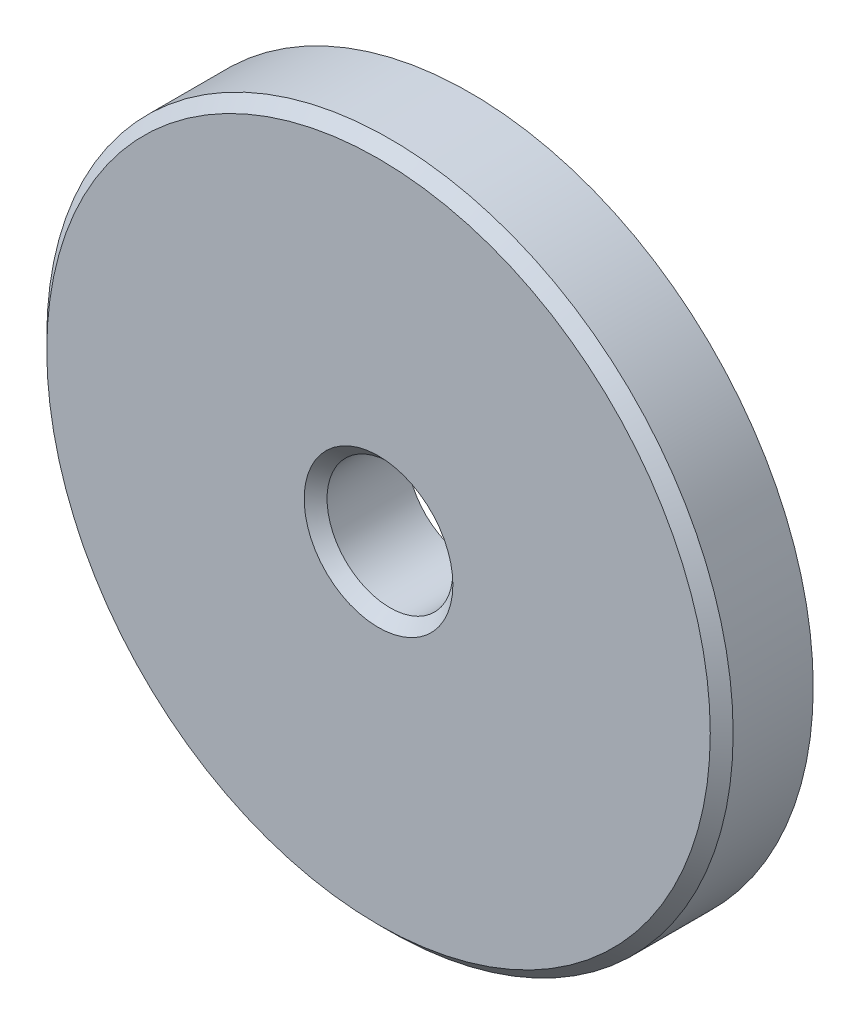
ISO-10303-21;
HEADER;
FILE_DESCRIPTION(('STEP AP214'),'2;1');
FILE_NAME('part.step','',(''),(''),'','','');
FILE_SCHEMA(('AUTOMOTIVE_DESIGN { 1 0 10303 214 1 1 1 1 }'));
ENDSEC;
DATA;
#1=APPLICATION_CONTEXT('core data for automotive mechanical design processes');
#2=APPLICATION_PROTOCOL_DEFINITION('international standard','automotive_design',2000,#1);
#3=PRODUCT_CONTEXT('',#1,'mechanical');
#4=PRODUCT('Part','Part','',(#3));
#5=PRODUCT_RELATED_PRODUCT_CATEGORY('part','',(#4));
#6=PRODUCT_DEFINITION_FORMATION('','',#4);
#7=PRODUCT_DEFINITION_CONTEXT('part definition',#1,'design');
#8=PRODUCT_DEFINITION('design','',#6,#7);
#9=PRODUCT_DEFINITION_SHAPE('','',#8);
#10=(LENGTH_UNIT() NAMED_UNIT(*) SI_UNIT(.MILLI.,.METRE.));
#11=(NAMED_UNIT(*) PLANE_ANGLE_UNIT() SI_UNIT($,.RADIAN.));
#12=(NAMED_UNIT(*) SI_UNIT($,.STERADIAN.) SOLID_ANGLE_UNIT());
#13=UNCERTAINTY_MEASURE_WITH_UNIT(LENGTH_MEASURE(1.E-05),#10,'distance_accuracy_value','');
#14=(GEOMETRIC_REPRESENTATION_CONTEXT(3) GLOBAL_UNCERTAINTY_ASSIGNED_CONTEXT((#13)) GLOBAL_UNIT_ASSIGNED_CONTEXT((#10,
#11,#12)) REPRESENTATION_CONTEXT('',''));
#15=CARTESIAN_POINT('',(0.,0.,0.));
#16=DIRECTION('',(0.,0.,1.));
#17=DIRECTION('',(1.,0.,0.));
#18=AXIS2_PLACEMENT_3D('',#15,#16,#17);
#19=CARTESIAN_POINT('',(0.,0.,4.));
#20=DIRECTION('',(0.,0.,1.));
#21=DIRECTION('',(1.,0.,0.));
#22=AXIS2_PLACEMENT_3D('',#19,#20,#21);
#23=PLANE('',#22);
#24=CARTESIAN_POINT('',(0.,0.,4.));
#25=DIRECTION('',(0.,0.,1.));
#26=DIRECTION('',(1.,0.,0.));
#27=AXIS2_PLACEMENT_3D('',#24,#25,#26);
#28=CIRCLE('',#27,3.25);
#29=CARTESIAN_POINT('',(3.25,0.,4.));
#30=VERTEX_POINT('',#29);
#31=EDGE_CURVE('E39',#30,#30,#28,.F.);
#32=ORIENTED_EDGE('',*,*,#31,.T.);
#33=EDGE_LOOP('',(#32));
#34=FACE_BOUND('',#33,.T.);
#35=CARTESIAN_POINT('',(0.,0.,4.));
#36=DIRECTION('',(0.,0.,1.));
#37=DIRECTION('',(1.,0.,0.));
#38=AXIS2_PLACEMENT_3D('',#35,#36,#37);
#39=CIRCLE('',#38,14.5);
#40=CARTESIAN_POINT('',(14.5,0.,4.));
#41=VERTEX_POINT('',#40);
#42=EDGE_CURVE('E43',#41,#41,#39,.T.);
#43=ORIENTED_EDGE('',*,*,#42,.T.);
#44=EDGE_LOOP('',(#43));
#45=FACE_BOUND('',#44,.T.);
#46=ADVANCED_FACE('F32',(#34,#45),#23,.T.);
#47=CARTESIAN_POINT('',(0.,0.,0.));
#48=DIRECTION('',(0.,0.,1.));
#49=DIRECTION('',(1.,0.,0.));
#50=AXIS2_PLACEMENT_3D('',#47,#48,#49);
#51=PLANE('',#50);
#52=CARTESIAN_POINT('',(0.,0.,0.));
#53=DIRECTION('',(0.,0.,1.));
#54=DIRECTION('',(1.,0.,0.));
#55=AXIS2_PLACEMENT_3D('',#52,#53,#54);
#56=CIRCLE('',#55,15.);
#57=CARTESIAN_POINT('',(15.,0.,0.));
#58=VERTEX_POINT('',#57);
#59=EDGE_CURVE('E52',#58,#58,#56,.T.);
#60=ORIENTED_EDGE('',*,*,#59,.F.);
#61=EDGE_LOOP('',(#60));
#62=FACE_BOUND('',#61,.T.);
#63=CARTESIAN_POINT('',(0.,0.,0.));
#64=DIRECTION('',(0.,0.,1.));
#65=DIRECTION('',(1.,0.,0.));
#66=AXIS2_PLACEMENT_3D('',#63,#64,#65);
#67=CIRCLE('',#66,2.75);
#68=CARTESIAN_POINT('',(2.75,0.,0.));
#69=VERTEX_POINT('',#68);
#70=EDGE_CURVE('E55',#69,#69,#67,.T.);
#71=ORIENTED_EDGE('',*,*,#70,.T.);
#72=EDGE_LOOP('',(#71));
#73=FACE_BOUND('',#72,.T.);
#74=ADVANCED_FACE('F59',(#62,#73),#51,.F.);
#75=CARTESIAN_POINT('',(0.,0.,4.));
#76=DIRECTION('',(0.,0.,-1.));
#77=DIRECTION('',(-1.,0.,0.));
#78=AXIS2_PLACEMENT_3D('',#75,#76,#77);
#79=CYLINDRICAL_SURFACE('',#78,15.);
#80=CARTESIAN_POINT('',(0.,0.,3.49999999999999));
#81=DIRECTION('',(0.,0.,1.));
#82=DIRECTION('',(1.,0.,0.));
#83=AXIS2_PLACEMENT_3D('',#80,#81,#82);
#84=CIRCLE('',#83,15.);
#85=CARTESIAN_POINT('',(15.,0.,3.49999999999999));
#86=VERTEX_POINT('',#85);
#87=EDGE_CURVE('E10',#86,#86,#84,.F.);
#88=ORIENTED_EDGE('',*,*,#87,.T.);
#89=EDGE_LOOP('',(#88));
#90=FACE_BOUND('',#89,.T.);
#91=ORIENTED_EDGE('',*,*,#59,.T.);
#92=EDGE_LOOP('',(#91));
#93=FACE_BOUND('',#92,.T.);
#94=ADVANCED_FACE('F64',(#90,#93),#79,.T.);
#95=CARTESIAN_POINT('',(0.,0.,4.));
#96=DIRECTION('',(0.,0.,-1.));
#97=DIRECTION('',(-1.,0.,0.));
#98=AXIS2_PLACEMENT_3D('',#95,#96,#97);
#99=CYLINDRICAL_SURFACE('',#98,2.75);
#100=CARTESIAN_POINT('',(0.,0.,3.5));
#101=DIRECTION('',(0.,0.,1.));
#102=DIRECTION('',(1.,0.,0.));
#103=AXIS2_PLACEMENT_3D('',#100,#101,#102);
#104=CIRCLE('',#103,2.75);
#105=CARTESIAN_POINT('',(2.75,0.,3.5));
#106=VERTEX_POINT('',#105);
#107=EDGE_CURVE('E47',#106,#106,#104,.T.);
#108=ORIENTED_EDGE('',*,*,#107,.T.);
#109=EDGE_LOOP('',(#108));
#110=FACE_BOUND('',#109,.T.);
#111=ORIENTED_EDGE('',*,*,#70,.F.);
#112=EDGE_LOOP('',(#111));
#113=FACE_BOUND('',#112,.T.);
#114=ADVANCED_FACE('F61',(#110,#113),#99,.F.);
#115=CARTESIAN_POINT('',(0.,0.,3.5));
#116=DIRECTION('',(0.,0.,1.));
#117=DIRECTION('',(1.,0.,0.));
#118=AXIS2_PLACEMENT_3D('',#115,#116,#117);
#119=CONICAL_SURFACE('',#118,2.75,0.785398163397446);
#120=ORIENTED_EDGE('',*,*,#31,.F.);
#121=EDGE_LOOP('',(#120));
#122=FACE_BOUND('',#121,.T.);
#123=ORIENTED_EDGE('',*,*,#107,.F.);
#124=EDGE_LOOP('',(#123));
#125=FACE_BOUND('',#124,.T.);
#126=ADVANCED_FACE('F63',(#122,#125),#119,.F.);
#127=CARTESIAN_POINT('',(0.,0.,4.));
#128=DIRECTION('',(0.,0.,-1.));
#129=DIRECTION('',(-1.,0.,0.));
#130=AXIS2_PLACEMENT_3D('',#127,#128,#129);
#131=CONICAL_SURFACE('',#130,14.5,0.785398163397443);
#132=ORIENTED_EDGE('',*,*,#87,.F.);
#133=EDGE_LOOP('',(#132));
#134=FACE_BOUND('',#133,.T.);
#135=ORIENTED_EDGE('',*,*,#42,.F.);
#136=EDGE_LOOP('',(#135));
#137=FACE_BOUND('',#136,.T.);
#138=ADVANCED_FACE('F34',(#134,#137),#131,.T.);
#139=CLOSED_SHELL('',(#46,#74,#94,#114,#126,#138));
#140=MANIFOLD_SOLID_BREP('B2',#139);
#141=ADVANCED_BREP_SHAPE_REPRESENTATION('',(#18,#140),#14);
#142=SHAPE_DEFINITION_REPRESENTATION(#9,#141);
ENDSEC;
END-ISO-10303-21;
